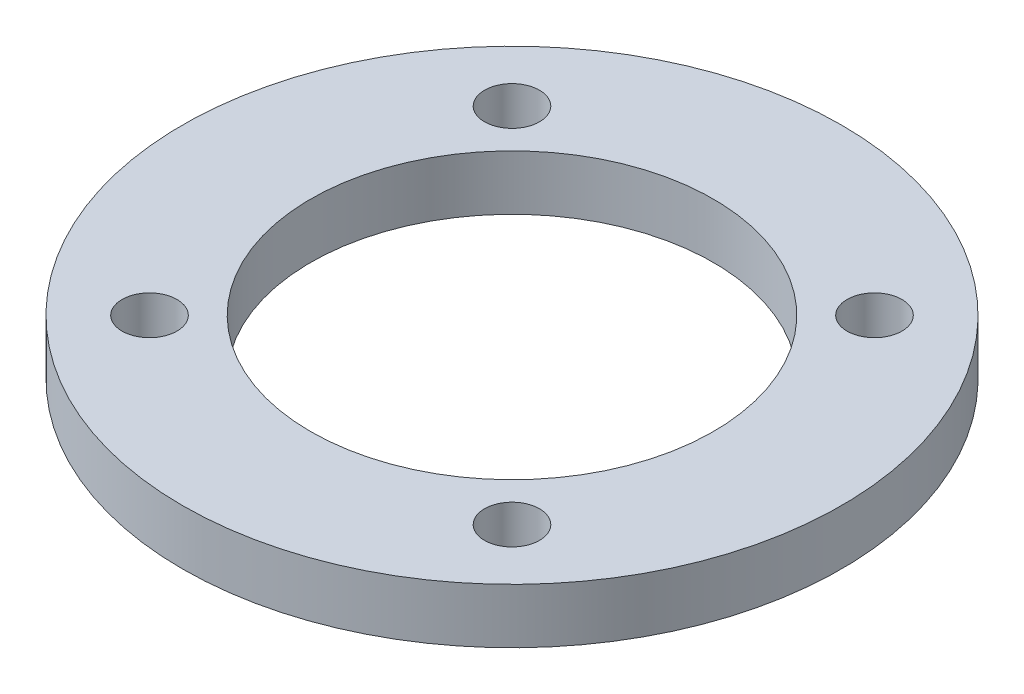
ISO-10303-21;
HEADER;
FILE_DESCRIPTION(('STEP AP214'),'2;1');
FILE_NAME('part.step','',(''),(''),'','','');
FILE_SCHEMA(('AUTOMOTIVE_DESIGN { 1 0 10303 214 1 1 1 1 }'));
ENDSEC;
DATA;
#1=APPLICATION_CONTEXT('core data for automotive mechanical design processes');
#2=APPLICATION_PROTOCOL_DEFINITION('international standard','automotive_design',2000,#1);
#3=PRODUCT_CONTEXT('',#1,'mechanical');
#4=PRODUCT('Part','Part','',(#3));
#5=PRODUCT_RELATED_PRODUCT_CATEGORY('part','',(#4));
#6=PRODUCT_DEFINITION_FORMATION('','',#4);
#7=PRODUCT_DEFINITION_CONTEXT('part definition',#1,'design');
#8=PRODUCT_DEFINITION('design','',#6,#7);
#9=PRODUCT_DEFINITION_SHAPE('','',#8);
#10=(LENGTH_UNIT() NAMED_UNIT(*) SI_UNIT(.MILLI.,.METRE.));
#11=(NAMED_UNIT(*) PLANE_ANGLE_UNIT() SI_UNIT($,.RADIAN.));
#12=(NAMED_UNIT(*) SI_UNIT($,.STERADIAN.) SOLID_ANGLE_UNIT());
#13=UNCERTAINTY_MEASURE_WITH_UNIT(LENGTH_MEASURE(1.E-05),#10,'distance_accuracy_value','');
#14=(GEOMETRIC_REPRESENTATION_CONTEXT(3) GLOBAL_UNCERTAINTY_ASSIGNED_CONTEXT((#13)) GLOBAL_UNIT_ASSIGNED_CONTEXT((#10,
#11,#12)) REPRESENTATION_CONTEXT('',''));
#15=CARTESIAN_POINT('',(0.,0.,0.));
#16=DIRECTION('',(0.,0.,1.));
#17=DIRECTION('',(1.,0.,0.));
#18=AXIS2_PLACEMENT_3D('',#15,#16,#17);
#19=CARTESIAN_POINT('',(0.,3.,0.));
#20=DIRECTION('',(0.,1.,0.));
#21=DIRECTION('',(0.,0.,1.));
#22=AXIS2_PLACEMENT_3D('',#19,#20,#21);
#23=PLANE('',#22);
#24=CARTESIAN_POINT('',(-9.89949493661172,3.,9.89949493661161));
#25=DIRECTION('',(0.,1.,0.));
#26=DIRECTION('',(0.,0.,1.));
#27=AXIS2_PLACEMENT_3D('',#24,#25,#26);
#28=CIRCLE('',#27,1.5);
#29=CARTESIAN_POINT('',(-9.89949493661172,3.,11.3994949366116));
#30=VERTEX_POINT('',#29);
#31=EDGE_CURVE('E76',#30,#30,#28,.T.);
#32=ORIENTED_EDGE('',*,*,#31,.F.);
#33=EDGE_LOOP('',(#32));
#34=FACE_BOUND('',#33,.T.);
#35=CARTESIAN_POINT('',(9.89949493661165,3.,-9.89949493661168));
#36=DIRECTION('',(0.,1.,0.));
#37=DIRECTION('',(0.,0.,1.));
#38=AXIS2_PLACEMENT_3D('',#35,#36,#37);
#39=CIRCLE('',#38,1.5);
#40=CARTESIAN_POINT('',(9.89949493661165,3.,-8.39949493661168));
#41=VERTEX_POINT('',#40);
#42=EDGE_CURVE('E60',#41,#41,#39,.T.);
#43=ORIENTED_EDGE('',*,*,#42,.F.);
#44=EDGE_LOOP('',(#43));
#45=FACE_BOUND('',#44,.T.);
#46=CARTESIAN_POINT('',(0.,3.,0.));
#47=DIRECTION('',(0.,1.,0.));
#48=DIRECTION('',(0.,0.,1.));
#49=AXIS2_PLACEMENT_3D('',#46,#47,#48);
#50=CIRCLE('',#49,18.);
#51=CARTESIAN_POINT('',(0.,3.,18.));
#52=VERTEX_POINT('',#51);
#53=EDGE_CURVE('E10',#52,#52,#50,.T.);
#54=ORIENTED_EDGE('',*,*,#53,.T.);
#55=EDGE_LOOP('',(#54));
#56=FACE_BOUND('',#55,.T.);
#57=CARTESIAN_POINT('',(0.,3.,0.));
#58=DIRECTION('',(0.,1.,0.));
#59=DIRECTION('',(0.,0.,1.));
#60=AXIS2_PLACEMENT_3D('',#57,#58,#59);
#61=CIRCLE('',#60,11.);
#62=CARTESIAN_POINT('',(0.,3.,11.));
#63=VERTEX_POINT('',#62);
#64=EDGE_CURVE('E54',#63,#63,#61,.T.);
#65=ORIENTED_EDGE('',*,*,#64,.F.);
#66=EDGE_LOOP('',(#65));
#67=FACE_BOUND('',#66,.T.);
#68=CARTESIAN_POINT('',(9.89949493661165,3.,9.89949493661168));
#69=DIRECTION('',(0.,1.,0.));
#70=DIRECTION('',(0.,0.,1.));
#71=AXIS2_PLACEMENT_3D('',#68,#69,#70);
#72=CIRCLE('',#71,1.5);
#73=CARTESIAN_POINT('',(9.89949493661165,3.,11.3994949366117));
#74=VERTEX_POINT('',#73);
#75=EDGE_CURVE('E68',#74,#74,#72,.T.);
#76=ORIENTED_EDGE('',*,*,#75,.F.);
#77=EDGE_LOOP('',(#76));
#78=FACE_BOUND('',#77,.T.);
#79=CARTESIAN_POINT('',(-9.89949493661158,3.,-9.89949493661175));
#80=DIRECTION('',(0.,1.,0.));
#81=DIRECTION('',(0.,0.,1.));
#82=AXIS2_PLACEMENT_3D('',#79,#80,#81);
#83=CIRCLE('',#82,1.5);
#84=CARTESIAN_POINT('',(-9.89949493661158,3.,-8.39949493661175));
#85=VERTEX_POINT('',#84);
#86=EDGE_CURVE('E84',#85,#85,#83,.T.);
#87=ORIENTED_EDGE('',*,*,#86,.F.);
#88=EDGE_LOOP('',(#87));
#89=FACE_BOUND('',#88,.T.);
#90=ADVANCED_FACE('F41',(#34,#45,#56,#67,#78,#89),#23,.T.);
#91=CARTESIAN_POINT('',(0.,0.,0.));
#92=DIRECTION('',(0.,1.,0.));
#93=DIRECTION('',(0.,0.,1.));
#94=AXIS2_PLACEMENT_3D('',#91,#92,#93);
#95=PLANE('',#94);
#96=CARTESIAN_POINT('',(0.,0.,0.));
#97=DIRECTION('',(0.,1.,0.));
#98=DIRECTION('',(0.,0.,1.));
#99=AXIS2_PLACEMENT_3D('',#96,#97,#98);
#100=CIRCLE('',#99,18.);
#101=CARTESIAN_POINT('',(0.,0.,18.));
#102=VERTEX_POINT('',#101);
#103=EDGE_CURVE('E45',#102,#102,#100,.T.);
#104=ORIENTED_EDGE('',*,*,#103,.F.);
#105=EDGE_LOOP('',(#104));
#106=FACE_BOUND('',#105,.T.);
#107=CARTESIAN_POINT('',(0.,0.,0.));
#108=DIRECTION('',(0.,1.,0.));
#109=DIRECTION('',(0.,0.,1.));
#110=AXIS2_PLACEMENT_3D('',#107,#108,#109);
#111=CIRCLE('',#110,11.);
#112=CARTESIAN_POINT('',(0.,0.,11.));
#113=VERTEX_POINT('',#112);
#114=EDGE_CURVE('E56',#113,#113,#111,.T.);
#115=ORIENTED_EDGE('',*,*,#114,.T.);
#116=EDGE_LOOP('',(#115));
#117=FACE_BOUND('',#116,.T.);
#118=CARTESIAN_POINT('',(9.89949493661165,0.,-9.89949493661168));
#119=DIRECTION('',(0.,1.,0.));
#120=DIRECTION('',(0.,0.,1.));
#121=AXIS2_PLACEMENT_3D('',#118,#119,#120);
#122=CIRCLE('',#121,1.5);
#123=CARTESIAN_POINT('',(9.89949493661165,0.,-8.39949493661168));
#124=VERTEX_POINT('',#123);
#125=EDGE_CURVE('E64',#124,#124,#122,.T.);
#126=ORIENTED_EDGE('',*,*,#125,.T.);
#127=EDGE_LOOP('',(#126));
#128=FACE_BOUND('',#127,.T.);
#129=CARTESIAN_POINT('',(9.89949493661165,0.,9.89949493661168));
#130=DIRECTION('',(0.,1.,0.));
#131=DIRECTION('',(0.,0.,1.));
#132=AXIS2_PLACEMENT_3D('',#129,#130,#131);
#133=CIRCLE('',#132,1.5);
#134=CARTESIAN_POINT('',(9.89949493661165,0.,11.3994949366117));
#135=VERTEX_POINT('',#134);
#136=EDGE_CURVE('E72',#135,#135,#133,.T.);
#137=ORIENTED_EDGE('',*,*,#136,.T.);
#138=EDGE_LOOP('',(#137));
#139=FACE_BOUND('',#138,.T.);
#140=CARTESIAN_POINT('',(-9.89949493661172,0.,9.89949493661161));
#141=DIRECTION('',(0.,1.,0.));
#142=DIRECTION('',(0.,0.,1.));
#143=AXIS2_PLACEMENT_3D('',#140,#141,#142);
#144=CIRCLE('',#143,1.5);
#145=CARTESIAN_POINT('',(-9.89949493661172,0.,11.3994949366116));
#146=VERTEX_POINT('',#145);
#147=EDGE_CURVE('E80',#146,#146,#144,.T.);
#148=ORIENTED_EDGE('',*,*,#147,.T.);
#149=EDGE_LOOP('',(#148));
#150=FACE_BOUND('',#149,.T.);
#151=CARTESIAN_POINT('',(-9.89949493661158,0.,-9.89949493661175));
#152=DIRECTION('',(0.,1.,0.));
#153=DIRECTION('',(0.,0.,1.));
#154=AXIS2_PLACEMENT_3D('',#151,#152,#153);
#155=CIRCLE('',#154,1.5);
#156=CARTESIAN_POINT('',(-9.89949493661158,0.,-8.39949493661175));
#157=VERTEX_POINT('',#156);
#158=EDGE_CURVE('E88',#157,#157,#155,.T.);
#159=ORIENTED_EDGE('',*,*,#158,.T.);
#160=EDGE_LOOP('',(#159));
#161=FACE_BOUND('',#160,.T.);
#162=ADVANCED_FACE('F100',(#106,#117,#128,#139,#150,#161),#95,.F.);
#163=CARTESIAN_POINT('',(0.,3.,0.));
#164=DIRECTION('',(0.,-1.,0.));
#165=DIRECTION('',(0.,0.,-1.));
#166=AXIS2_PLACEMENT_3D('',#163,#164,#165);
#167=CYLINDRICAL_SURFACE('',#166,18.);
#168=ORIENTED_EDGE('',*,*,#53,.F.);
#169=EDGE_LOOP('',(#168));
#170=FACE_BOUND('',#169,.T.);
#171=ORIENTED_EDGE('',*,*,#103,.T.);
#172=EDGE_LOOP('',(#171));
#173=FACE_BOUND('',#172,.T.);
#174=ADVANCED_FACE('F43',(#170,#173),#167,.T.);
#175=CARTESIAN_POINT('',(0.,3.,0.));
#176=DIRECTION('',(0.,-1.,0.));
#177=DIRECTION('',(0.,0.,-1.));
#178=AXIS2_PLACEMENT_3D('',#175,#176,#177);
#179=CYLINDRICAL_SURFACE('',#178,11.);
#180=ORIENTED_EDGE('',*,*,#64,.T.);
#181=EDGE_LOOP('',(#180));
#182=FACE_BOUND('',#181,.T.);
#183=ORIENTED_EDGE('',*,*,#114,.F.);
#184=EDGE_LOOP('',(#183));
#185=FACE_BOUND('',#184,.T.);
#186=ADVANCED_FACE('F110',(#182,#185),#179,.F.);
#187=CARTESIAN_POINT('',(9.89949493661165,3.,-9.89949493661168));
#188=DIRECTION('',(0.,-1.,0.));
#189=DIRECTION('',(0.,0.,-1.));
#190=AXIS2_PLACEMENT_3D('',#187,#188,#189);
#191=CYLINDRICAL_SURFACE('',#190,1.5);
#192=ORIENTED_EDGE('',*,*,#42,.T.);
#193=EDGE_LOOP('',(#192));
#194=FACE_BOUND('',#193,.T.);
#195=ORIENTED_EDGE('',*,*,#125,.F.);
#196=EDGE_LOOP('',(#195));
#197=FACE_BOUND('',#196,.T.);
#198=ADVANCED_FACE('F113',(#194,#197),#191,.F.);
#199=CARTESIAN_POINT('',(9.89949493661165,3.,9.89949493661168));
#200=DIRECTION('',(0.,-1.,0.));
#201=DIRECTION('',(0.,0.,-1.));
#202=AXIS2_PLACEMENT_3D('',#199,#200,#201);
#203=CYLINDRICAL_SURFACE('',#202,1.5);
#204=ORIENTED_EDGE('',*,*,#75,.T.);
#205=EDGE_LOOP('',(#204));
#206=FACE_BOUND('',#205,.T.);
#207=ORIENTED_EDGE('',*,*,#136,.F.);
#208=EDGE_LOOP('',(#207));
#209=FACE_BOUND('',#208,.T.);
#210=ADVANCED_FACE('F117',(#206,#209),#203,.F.);
#211=CARTESIAN_POINT('',(-9.89949493661172,3.,9.89949493661161));
#212=DIRECTION('',(0.,-1.,0.));
#213=DIRECTION('',(0.,0.,-1.));
#214=AXIS2_PLACEMENT_3D('',#211,#212,#213);
#215=CYLINDRICAL_SURFACE('',#214,1.5);
#216=ORIENTED_EDGE('',*,*,#31,.T.);
#217=EDGE_LOOP('',(#216));
#218=FACE_BOUND('',#217,.T.);
#219=ORIENTED_EDGE('',*,*,#147,.F.);
#220=EDGE_LOOP('',(#219));
#221=FACE_BOUND('',#220,.T.);
#222=ADVANCED_FACE('F121',(#218,#221),#215,.F.);
#223=CARTESIAN_POINT('',(-9.89949493661158,3.,-9.89949493661175));
#224=DIRECTION('',(0.,-1.,0.));
#225=DIRECTION('',(0.,0.,-1.));
#226=AXIS2_PLACEMENT_3D('',#223,#224,#225);
#227=CYLINDRICAL_SURFACE('',#226,1.5);
#228=ORIENTED_EDGE('',*,*,#86,.T.);
#229=EDGE_LOOP('',(#228));
#230=FACE_BOUND('',#229,.T.);
#231=ORIENTED_EDGE('',*,*,#158,.F.);
#232=EDGE_LOOP('',(#231));
#233=FACE_BOUND('',#232,.T.);
#234=ADVANCED_FACE('F96',(#230,#233),#227,.F.);
#235=CLOSED_SHELL('',(#90,#162,#174,#186,#198,#210,#222,#234));
#236=MANIFOLD_SOLID_BREP('B2',#235);
#237=ADVANCED_BREP_SHAPE_REPRESENTATION('',(#18,#236),#14);
#238=SHAPE_DEFINITION_REPRESENTATION(#9,#237);
ENDSEC;
END-ISO-10303-21;
